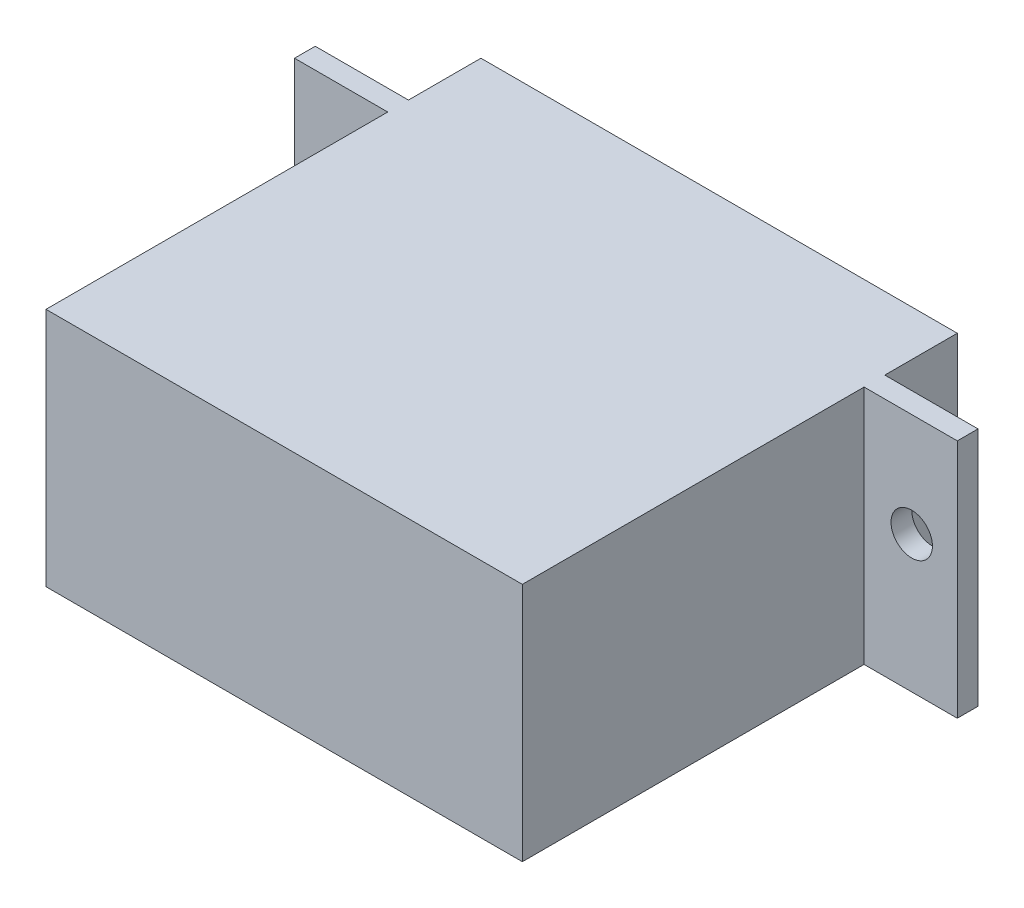
ISO-10303-21;
HEADER;
FILE_DESCRIPTION(('STEP AP214'),'2;1');
FILE_NAME('part.step','',(''),(''),'','','');
FILE_SCHEMA(('AUTOMOTIVE_DESIGN { 1 0 10303 214 1 1 1 1 }'));
ENDSEC;
DATA;
#1=APPLICATION_CONTEXT('core data for automotive mechanical design processes');
#2=APPLICATION_PROTOCOL_DEFINITION('international standard','automotive_design',2000,#1);
#3=PRODUCT_CONTEXT('',#1,'mechanical');
#4=PRODUCT('Part','Part','',(#3));
#5=PRODUCT_RELATED_PRODUCT_CATEGORY('part','',(#4));
#6=PRODUCT_DEFINITION_FORMATION('','',#4);
#7=PRODUCT_DEFINITION_CONTEXT('part definition',#1,'design');
#8=PRODUCT_DEFINITION('design','',#6,#7);
#9=PRODUCT_DEFINITION_SHAPE('','',#8);
#10=(LENGTH_UNIT() NAMED_UNIT(*) SI_UNIT(.MILLI.,.METRE.));
#11=(NAMED_UNIT(*) PLANE_ANGLE_UNIT() SI_UNIT($,.RADIAN.));
#12=(NAMED_UNIT(*) SI_UNIT($,.STERADIAN.) SOLID_ANGLE_UNIT());
#13=UNCERTAINTY_MEASURE_WITH_UNIT(LENGTH_MEASURE(1.E-05),#10,'distance_accuracy_value','');
#14=(GEOMETRIC_REPRESENTATION_CONTEXT(3) GLOBAL_UNCERTAINTY_ASSIGNED_CONTEXT((#13)) GLOBAL_UNIT_ASSIGNED_CONTEXT((#10,
#11,#12)) REPRESENTATION_CONTEXT('',''));
#15=CARTESIAN_POINT('',(0.,0.,0.));
#16=DIRECTION('',(0.,0.,1.));
#17=DIRECTION('',(1.,0.,0.));
#18=AXIS2_PLACEMENT_3D('',#15,#16,#17);
#19=CARTESIAN_POINT('',(-11.5,11.6,-10.5));
#20=DIRECTION('',(1.,0.,0.));
#21=DIRECTION('',(0.,0.,-1.));
#22=AXIS2_PLACEMENT_3D('',#19,#20,#21);
#23=PLANE('',#22);
#24=DIRECTION('',(0.,0.,1.));
#25=VECTOR('',#24,1.);
#26=CARTESIAN_POINT('',(-11.5,0.,-10.5));
#27=LINE('',#26,#25);
#28=CARTESIAN_POINT('',(-11.5,0.,-10.5));
#29=VERTEX_POINT('',#28);
#30=CARTESIAN_POINT('',(-11.5,0.,-7.));
#31=VERTEX_POINT('',#30);
#32=EDGE_CURVE('E255',#29,#31,#27,.T.);
#33=ORIENTED_EDGE('',*,*,#32,.T.);
#34=DIRECTION('',(0.,1.,0.));
#35=VECTOR('',#34,1.);
#36=CARTESIAN_POINT('',(-11.5,0.,-7.));
#37=LINE('',#36,#35);
#38=CARTESIAN_POINT('',(-11.5,11.6,-7.));
#39=VERTEX_POINT('',#38);
#40=EDGE_CURVE('E172',#31,#39,#37,.T.);
#41=ORIENTED_EDGE('',*,*,#40,.T.);
#42=DIRECTION('',(0.,0.,1.));
#43=VECTOR('',#42,1.);
#44=CARTESIAN_POINT('',(-11.5,11.6,-10.5));
#45=LINE('',#44,#43);
#46=CARTESIAN_POINT('',(-11.5,11.6,-10.5));
#47=VERTEX_POINT('',#46);
#48=EDGE_CURVE('E241',#47,#39,#45,.T.);
#49=ORIENTED_EDGE('',*,*,#48,.F.);
#50=DIRECTION('',(0.,-1.,0.));
#51=VECTOR('',#50,1.);
#52=CARTESIAN_POINT('',(-11.5,11.6,-10.5));
#53=LINE('',#52,#51);
#54=EDGE_CURVE('E269',#47,#29,#53,.T.);
#55=ORIENTED_EDGE('',*,*,#54,.T.);
#56=EDGE_LOOP('',(#33,#41,#49,#55));
#57=FACE_BOUND('',#56,.T.);
#58=ADVANCED_FACE('F42',(#57),#23,.F.);
#59=CARTESIAN_POINT('',(11.5,11.6,-10.5));
#60=DIRECTION('',(-1.,0.,0.));
#61=DIRECTION('',(0.,0.,1.));
#62=AXIS2_PLACEMENT_3D('',#59,#60,#61);
#63=PLANE('',#62);
#64=DIRECTION('',(0.,-1.,0.));
#65=VECTOR('',#64,1.);
#66=CARTESIAN_POINT('',(11.5,11.6,-6.));
#67=LINE('',#66,#65);
#68=CARTESIAN_POINT('',(11.5,11.6,-6.));
#69=VERTEX_POINT('',#68);
#70=CARTESIAN_POINT('',(11.5,0.,-6.));
#71=VERTEX_POINT('',#70);
#72=EDGE_CURVE('E70',#69,#71,#67,.T.);
#73=ORIENTED_EDGE('',*,*,#72,.F.);
#74=DIRECTION('',(0.,0.,-1.));
#75=VECTOR('',#74,1.);
#76=CARTESIAN_POINT('',(11.5,11.6,-10.5));
#77=LINE('',#76,#75);
#78=CARTESIAN_POINT('',(11.5,11.6,10.5));
#79=VERTEX_POINT('',#78);
#80=EDGE_CURVE('E233',#79,#69,#77,.T.);
#81=ORIENTED_EDGE('',*,*,#80,.F.);
#82=DIRECTION('',(0.,-1.,0.));
#83=VECTOR('',#82,1.);
#84=CARTESIAN_POINT('',(11.5,11.6,10.5));
#85=LINE('',#84,#83);
#86=CARTESIAN_POINT('',(11.5,0.,10.5));
#87=VERTEX_POINT('',#86);
#88=EDGE_CURVE('E248',#79,#87,#85,.T.);
#89=ORIENTED_EDGE('',*,*,#88,.T.);
#90=DIRECTION('',(0.,0.,-1.));
#91=VECTOR('',#90,1.);
#92=CARTESIAN_POINT('',(11.5,0.,-10.5));
#93=LINE('',#92,#91);
#94=EDGE_CURVE('E249',#87,#71,#93,.T.);
#95=ORIENTED_EDGE('',*,*,#94,.T.);
#96=EDGE_LOOP('',(#73,#81,#89,#95));
#97=FACE_BOUND('',#96,.T.);
#98=ADVANCED_FACE('F44',(#97),#63,.F.);
#99=DIRECTION('',(0.,1.,0.));
#100=VECTOR('',#99,1.);
#101=CARTESIAN_POINT('',(11.5,0.,-7.));
#102=LINE('',#101,#100);
#103=CARTESIAN_POINT('',(11.5,0.,-7.));
#104=VERTEX_POINT('',#103);
#105=CARTESIAN_POINT('',(11.5,11.6,-7.));
#106=VERTEX_POINT('',#105);
#107=EDGE_CURVE('E161',#104,#106,#102,.T.);
#108=ORIENTED_EDGE('',*,*,#107,.F.);
#109=CARTESIAN_POINT('',(11.5,0.,-10.5));
#110=VERTEX_POINT('',#109);
#111=EDGE_CURVE('E232',#104,#110,#93,.T.);
#112=ORIENTED_EDGE('',*,*,#111,.T.);
#113=DIRECTION('',(0.,-1.,0.));
#114=VECTOR('',#113,1.);
#115=CARTESIAN_POINT('',(11.5,11.6,-10.5));
#116=LINE('',#115,#114);
#117=CARTESIAN_POINT('',(11.5,11.6,-10.5));
#118=VERTEX_POINT('',#117);
#119=EDGE_CURVE('E52',#118,#110,#116,.T.);
#120=ORIENTED_EDGE('',*,*,#119,.F.);
#121=EDGE_CURVE('E237',#106,#118,#77,.T.);
#122=ORIENTED_EDGE('',*,*,#121,.F.);
#123=EDGE_LOOP('',(#108,#112,#120,#122));
#124=FACE_BOUND('',#123,.T.);
#125=ADVANCED_FACE('F283',(#124),#63,.F.);
#126=CARTESIAN_POINT('',(-11.5,11.6,-10.5));
#127=DIRECTION('',(0.,0.,1.));
#128=DIRECTION('',(1.,0.,0.));
#129=AXIS2_PLACEMENT_3D('',#126,#127,#128);
#130=PLANE('',#129);
#131=CARTESIAN_POINT('',(5.5,5.8,-10.5));
#132=DIRECTION('',(0.,0.,1.));
#133=DIRECTION('',(1.,0.,0.));
#134=AXIS2_PLACEMENT_3D('',#131,#132,#133);
#135=CIRCLE('',#134,2.);
#136=CARTESIAN_POINT('',(7.5,5.8,-10.5));
#137=VERTEX_POINT('',#136);
#138=EDGE_CURVE('E11',#137,#137,#135,.F.);
#139=ORIENTED_EDGE('',*,*,#138,.F.);
#140=EDGE_LOOP('',(#139));
#141=FACE_BOUND('',#140,.T.);
#142=DIRECTION('',(-1.,0.,0.));
#143=VECTOR('',#142,1.);
#144=CARTESIAN_POINT('',(-11.5,0.,-10.5));
#145=LINE('',#144,#143);
#146=EDGE_CURVE('E252',#110,#29,#145,.T.);
#147=ORIENTED_EDGE('',*,*,#146,.T.);
#148=ORIENTED_EDGE('',*,*,#54,.F.);
#149=DIRECTION('',(-1.,0.,0.));
#150=VECTOR('',#149,1.);
#151=CARTESIAN_POINT('',(-11.5,11.6,-10.5));
#152=LINE('',#151,#150);
#153=EDGE_CURVE('E236',#118,#47,#152,.T.);
#154=ORIENTED_EDGE('',*,*,#153,.F.);
#155=ORIENTED_EDGE('',*,*,#119,.T.);
#156=EDGE_LOOP('',(#147,#148,#154,#155));
#157=FACE_BOUND('',#156,.T.);
#158=ADVANCED_FACE('F279',(#141,#157),#130,.F.);
#159=CARTESIAN_POINT('',(-11.5,11.6,-6.));
#160=VERTEX_POINT('',#159);
#161=CARTESIAN_POINT('',(-11.5,11.6,10.5));
#162=VERTEX_POINT('',#161);
#163=EDGE_CURVE('E240',#160,#162,#45,.T.);
#164=ORIENTED_EDGE('',*,*,#163,.F.);
#165=DIRECTION('',(0.,-1.,0.));
#166=VECTOR('',#165,1.);
#167=CARTESIAN_POINT('',(-11.5,11.6,-6.));
#168=LINE('',#167,#166);
#169=CARTESIAN_POINT('',(-11.5,0.,-6.));
#170=VERTEX_POINT('',#169);
#171=EDGE_CURVE('E186',#160,#170,#168,.T.);
#172=ORIENTED_EDGE('',*,*,#171,.T.);
#173=CARTESIAN_POINT('',(-11.5,0.,10.5));
#174=VERTEX_POINT('',#173);
#175=EDGE_CURVE('E160',#170,#174,#27,.T.);
#176=ORIENTED_EDGE('',*,*,#175,.T.);
#177=DIRECTION('',(0.,-1.,0.));
#178=VECTOR('',#177,1.);
#179=CARTESIAN_POINT('',(-11.5,11.6,10.5));
#180=LINE('',#179,#178);
#181=EDGE_CURVE('E265',#162,#174,#180,.T.);
#182=ORIENTED_EDGE('',*,*,#181,.F.);
#183=EDGE_LOOP('',(#164,#172,#176,#182));
#184=FACE_BOUND('',#183,.T.);
#185=ADVANCED_FACE('F335',(#184),#23,.F.);
#186=CARTESIAN_POINT('',(-11.5,11.6,10.5));
#187=DIRECTION('',(0.,0.,-1.));
#188=DIRECTION('',(-1.,0.,0.));
#189=AXIS2_PLACEMENT_3D('',#186,#187,#188);
#190=PLANE('',#189);
#191=DIRECTION('',(1.,0.,0.));
#192=VECTOR('',#191,1.);
#193=CARTESIAN_POINT('',(-11.5,0.,10.5));
#194=LINE('',#193,#192);
#195=EDGE_CURVE('E259',#174,#87,#194,.T.);
#196=ORIENTED_EDGE('',*,*,#195,.T.);
#197=ORIENTED_EDGE('',*,*,#88,.F.);
#198=DIRECTION('',(1.,0.,0.));
#199=VECTOR('',#198,1.);
#200=CARTESIAN_POINT('',(-11.5,11.6,10.5));
#201=LINE('',#200,#199);
#202=EDGE_CURVE('E245',#162,#79,#201,.T.);
#203=ORIENTED_EDGE('',*,*,#202,.F.);
#204=ORIENTED_EDGE('',*,*,#181,.T.);
#205=EDGE_LOOP('',(#196,#197,#203,#204));
#206=FACE_BOUND('',#205,.T.);
#207=ADVANCED_FACE('F341',(#206),#190,.F.);
#208=CARTESIAN_POINT('',(0.,11.6,0.));
#209=DIRECTION('',(0.,1.,0.));
#210=DIRECTION('',(0.,0.,1.));
#211=AXIS2_PLACEMENT_3D('',#208,#209,#210);
#212=PLANE('',#211);
#213=ORIENTED_EDGE('',*,*,#80,.T.);
#214=DIRECTION('',(-1.,0.,0.));
#215=VECTOR('',#214,1.);
#216=CARTESIAN_POINT('',(16.,11.6,-6.));
#217=LINE('',#216,#215);
#218=CARTESIAN_POINT('',(16.,11.6,-6.));
#219=VERTEX_POINT('',#218);
#220=EDGE_CURVE('E221',#219,#69,#217,.T.);
#221=ORIENTED_EDGE('',*,*,#220,.F.);
#222=DIRECTION('',(0.,0.,1.));
#223=VECTOR('',#222,1.);
#224=CARTESIAN_POINT('',(16.,11.6,-7.));
#225=LINE('',#224,#223);
#226=CARTESIAN_POINT('',(16.,11.6,-7.));
#227=VERTEX_POINT('',#226);
#228=EDGE_CURVE('E206',#227,#219,#225,.T.);
#229=ORIENTED_EDGE('',*,*,#228,.F.);
#230=DIRECTION('',(-1.,0.,0.));
#231=VECTOR('',#230,1.);
#232=CARTESIAN_POINT('',(16.,11.6,-7.));
#233=LINE('',#232,#231);
#234=EDGE_CURVE('E225',#227,#106,#233,.T.);
#235=ORIENTED_EDGE('',*,*,#234,.T.);
#236=ORIENTED_EDGE('',*,*,#121,.T.);
#237=ORIENTED_EDGE('',*,*,#153,.T.);
#238=ORIENTED_EDGE('',*,*,#48,.T.);
#239=DIRECTION('',(1.,0.,0.));
#240=VECTOR('',#239,1.);
#241=CARTESIAN_POINT('',(-16.,11.6,-7.));
#242=LINE('',#241,#240);
#243=CARTESIAN_POINT('',(-16.,11.6,-7.));
#244=VERTEX_POINT('',#243);
#245=EDGE_CURVE('E194',#244,#39,#242,.T.);
#246=ORIENTED_EDGE('',*,*,#245,.F.);
#247=DIRECTION('',(0.,0.,1.));
#248=VECTOR('',#247,1.);
#249=CARTESIAN_POINT('',(-16.,11.6,-7.));
#250=LINE('',#249,#248);
#251=CARTESIAN_POINT('',(-16.,11.6,-6.));
#252=VERTEX_POINT('',#251);
#253=EDGE_CURVE('E176',#244,#252,#250,.T.);
#254=ORIENTED_EDGE('',*,*,#253,.T.);
#255=DIRECTION('',(1.,0.,0.));
#256=VECTOR('',#255,1.);
#257=CARTESIAN_POINT('',(-16.,11.6,-6.));
#258=LINE('',#257,#256);
#259=EDGE_CURVE('E162',#252,#160,#258,.T.);
#260=ORIENTED_EDGE('',*,*,#259,.T.);
#261=ORIENTED_EDGE('',*,*,#163,.T.);
#262=ORIENTED_EDGE('',*,*,#202,.T.);
#263=EDGE_LOOP('',(#213,#221,#229,#235,#236,#237,#238,#246,#254,#260,#261,#262));
#264=FACE_BOUND('',#263,.T.);
#265=ADVANCED_FACE('F292',(#264),#212,.T.);
#266=CARTESIAN_POINT('',(0.,0.,0.));
#267=DIRECTION('',(0.,1.,0.));
#268=DIRECTION('',(0.,0.,1.));
#269=AXIS2_PLACEMENT_3D('',#266,#267,#268);
#270=PLANE('',#269);
#271=ORIENTED_EDGE('',*,*,#94,.F.);
#272=ORIENTED_EDGE('',*,*,#195,.F.);
#273=ORIENTED_EDGE('',*,*,#175,.F.);
#274=DIRECTION('',(1.,0.,0.));
#275=VECTOR('',#274,1.);
#276=CARTESIAN_POINT('',(-16.,0.,-6.));
#277=LINE('',#276,#275);
#278=CARTESIAN_POINT('',(-16.,0.,-6.));
#279=VERTEX_POINT('',#278);
#280=EDGE_CURVE('E59',#279,#170,#277,.T.);
#281=ORIENTED_EDGE('',*,*,#280,.F.);
#282=DIRECTION('',(0.,0.,-1.));
#283=VECTOR('',#282,1.);
#284=CARTESIAN_POINT('',(-16.,0.,-6.));
#285=LINE('',#284,#283);
#286=CARTESIAN_POINT('',(-16.,0.,-7.));
#287=VERTEX_POINT('',#286);
#288=EDGE_CURVE('E157',#279,#287,#285,.T.);
#289=ORIENTED_EDGE('',*,*,#288,.T.);
#290=DIRECTION('',(1.,0.,0.));
#291=VECTOR('',#290,1.);
#292=CARTESIAN_POINT('',(-16.,0.,-7.));
#293=LINE('',#292,#291);
#294=EDGE_CURVE('E185',#287,#31,#293,.T.);
#295=ORIENTED_EDGE('',*,*,#294,.T.);
#296=ORIENTED_EDGE('',*,*,#32,.F.);
#297=ORIENTED_EDGE('',*,*,#146,.F.);
#298=ORIENTED_EDGE('',*,*,#111,.F.);
#299=DIRECTION('',(-1.,0.,0.));
#300=VECTOR('',#299,1.);
#301=CARTESIAN_POINT('',(16.,0.,-7.));
#302=LINE('',#301,#300);
#303=CARTESIAN_POINT('',(16.,0.,-7.));
#304=VERTEX_POINT('',#303);
#305=EDGE_CURVE('E229',#304,#104,#302,.T.);
#306=ORIENTED_EDGE('',*,*,#305,.F.);
#307=DIRECTION('',(0.,0.,-1.));
#308=VECTOR('',#307,1.);
#309=CARTESIAN_POINT('',(16.,0.,-6.));
#310=LINE('',#309,#308);
#311=CARTESIAN_POINT('',(16.,0.,-6.));
#312=VERTEX_POINT('',#311);
#313=EDGE_CURVE('E199',#312,#304,#310,.T.);
#314=ORIENTED_EDGE('',*,*,#313,.F.);
#315=DIRECTION('',(-1.,0.,0.));
#316=VECTOR('',#315,1.);
#317=CARTESIAN_POINT('',(16.,0.,-6.));
#318=LINE('',#317,#316);
#319=EDGE_CURVE('E212',#312,#71,#318,.T.);
#320=ORIENTED_EDGE('',*,*,#319,.T.);
#321=EDGE_LOOP('',(#271,#272,#273,#281,#289,#295,#296,#297,#298,#306,#314,#320));
#322=FACE_BOUND('',#321,.T.);
#323=ADVANCED_FACE('F156',(#322),#270,.F.);
#324=CARTESIAN_POINT('',(16.,0.,-7.));
#325=DIRECTION('',(0.,0.,1.));
#326=DIRECTION('',(1.,0.,0.));
#327=AXIS2_PLACEMENT_3D('',#324,#325,#326);
#328=PLANE('',#327);
#329=CARTESIAN_POINT('',(13.8,6.6,-7.));
#330=DIRECTION('',(0.,0.,-1.));
#331=DIRECTION('',(-1.,0.,0.));
#332=AXIS2_PLACEMENT_3D('',#329,#330,#331);
#333=CIRCLE('',#332,1.);
#334=CARTESIAN_POINT('',(12.8,6.6,-7.));
#335=VERTEX_POINT('',#334);
#336=EDGE_CURVE('E297',#335,#335,#333,.T.);
#337=ORIENTED_EDGE('',*,*,#336,.F.);
#338=EDGE_LOOP('',(#337));
#339=FACE_BOUND('',#338,.T.);
#340=ORIENTED_EDGE('',*,*,#107,.T.);
#341=ORIENTED_EDGE('',*,*,#234,.F.);
#342=DIRECTION('',(0.,1.,0.));
#343=VECTOR('',#342,1.);
#344=CARTESIAN_POINT('',(16.,0.,-7.));
#345=LINE('',#344,#343);
#346=EDGE_CURVE('E203',#304,#227,#345,.T.);
#347=ORIENTED_EDGE('',*,*,#346,.F.);
#348=ORIENTED_EDGE('',*,*,#305,.T.);
#349=EDGE_LOOP('',(#340,#341,#347,#348));
#350=FACE_BOUND('',#349,.T.);
#351=ADVANCED_FACE('F357',(#339,#350),#328,.F.);
#352=CARTESIAN_POINT('',(16.,11.6,-6.));
#353=DIRECTION('',(0.,0.,-1.));
#354=DIRECTION('',(0.,1.,0.));
#355=AXIS2_PLACEMENT_3D('',#352,#353,#354);
#356=PLANE('',#355);
#357=CARTESIAN_POINT('',(13.8,6.6,-6.));
#358=DIRECTION('',(0.,0.,-1.));
#359=DIRECTION('',(0.,1.,0.));
#360=AXIS2_PLACEMENT_3D('',#357,#358,#359);
#361=CIRCLE('',#360,1.);
#362=CARTESIAN_POINT('',(13.8,7.6,-6.));
#363=VERTEX_POINT('',#362);
#364=EDGE_CURVE('E46',#363,#363,#361,.T.);
#365=ORIENTED_EDGE('',*,*,#364,.T.);
#366=EDGE_LOOP('',(#365));
#367=FACE_BOUND('',#366,.T.);
#368=ORIENTED_EDGE('',*,*,#72,.T.);
#369=ORIENTED_EDGE('',*,*,#319,.F.);
#370=DIRECTION('',(0.,-1.,0.));
#371=VECTOR('',#370,1.);
#372=CARTESIAN_POINT('',(16.,11.6,-6.));
#373=LINE('',#372,#371);
#374=EDGE_CURVE('E209',#219,#312,#373,.T.);
#375=ORIENTED_EDGE('',*,*,#374,.F.);
#376=ORIENTED_EDGE('',*,*,#220,.T.);
#377=EDGE_LOOP('',(#368,#369,#375,#376));
#378=FACE_BOUND('',#377,.T.);
#379=ADVANCED_FACE('F362',(#367,#378),#356,.F.);
#380=CARTESIAN_POINT('',(16.,0.,0.));
#381=DIRECTION('',(1.,0.,0.));
#382=DIRECTION('',(0.,0.,-1.));
#383=AXIS2_PLACEMENT_3D('',#380,#381,#382);
#384=PLANE('',#383);
#385=ORIENTED_EDGE('',*,*,#313,.T.);
#386=ORIENTED_EDGE('',*,*,#346,.T.);
#387=ORIENTED_EDGE('',*,*,#228,.T.);
#388=ORIENTED_EDGE('',*,*,#374,.T.);
#389=EDGE_LOOP('',(#385,#386,#387,#388));
#390=FACE_BOUND('',#389,.T.);
#391=ADVANCED_FACE('F366',(#390),#384,.T.);
#392=CARTESIAN_POINT('',(-16.,11.6,-6.));
#393=DIRECTION('',(0.,0.,1.));
#394=DIRECTION('',(0.,-1.,0.));
#395=AXIS2_PLACEMENT_3D('',#392,#393,#394);
#396=PLANE('',#395);
#397=CARTESIAN_POINT('',(-13.8,6.6,-6.));
#398=DIRECTION('',(0.,0.,1.));
#399=DIRECTION('',(0.,-1.,0.));
#400=AXIS2_PLACEMENT_3D('',#397,#398,#399);
#401=CIRCLE('',#400,1.);
#402=CARTESIAN_POINT('',(-13.8,5.59999999999999,-6.));
#403=VERTEX_POINT('',#402);
#404=EDGE_CURVE('E301',#403,#403,#401,.T.);
#405=ORIENTED_EDGE('',*,*,#404,.F.);
#406=EDGE_LOOP('',(#405));
#407=FACE_BOUND('',#406,.T.);
#408=ORIENTED_EDGE('',*,*,#171,.F.);
#409=ORIENTED_EDGE('',*,*,#259,.F.);
#410=DIRECTION('',(0.,-1.,0.));
#411=VECTOR('',#410,1.);
#412=CARTESIAN_POINT('',(-16.,11.6,-6.));
#413=LINE('',#412,#411);
#414=EDGE_CURVE('E168',#252,#279,#413,.T.);
#415=ORIENTED_EDGE('',*,*,#414,.T.);
#416=ORIENTED_EDGE('',*,*,#280,.T.);
#417=EDGE_LOOP('',(#408,#409,#415,#416));
#418=FACE_BOUND('',#417,.T.);
#419=ADVANCED_FACE('F174',(#407,#418),#396,.T.);
#420=CARTESIAN_POINT('',(-16.,0.,-7.));
#421=DIRECTION('',(0.,0.,-1.));
#422=DIRECTION('',(-1.,0.,0.));
#423=AXIS2_PLACEMENT_3D('',#420,#421,#422);
#424=PLANE('',#423);
#425=CARTESIAN_POINT('',(-13.8,6.6,-7.));
#426=DIRECTION('',(0.,0.,-1.));
#427=DIRECTION('',(1.,0.,0.));
#428=AXIS2_PLACEMENT_3D('',#425,#426,#427);
#429=CIRCLE('',#428,1.);
#430=CARTESIAN_POINT('',(-12.8,6.6,-7.));
#431=VERTEX_POINT('',#430);
#432=EDGE_CURVE('E308',#431,#431,#429,.T.);
#433=ORIENTED_EDGE('',*,*,#432,.F.);
#434=EDGE_LOOP('',(#433));
#435=FACE_BOUND('',#434,.T.);
#436=ORIENTED_EDGE('',*,*,#40,.F.);
#437=ORIENTED_EDGE('',*,*,#294,.F.);
#438=DIRECTION('',(0.,1.,0.));
#439=VECTOR('',#438,1.);
#440=CARTESIAN_POINT('',(-16.,0.,-7.));
#441=LINE('',#440,#439);
#442=EDGE_CURVE('E171',#287,#244,#441,.T.);
#443=ORIENTED_EDGE('',*,*,#442,.T.);
#444=ORIENTED_EDGE('',*,*,#245,.T.);
#445=EDGE_LOOP('',(#436,#437,#443,#444));
#446=FACE_BOUND('',#445,.T.);
#447=ADVANCED_FACE('F373',(#435,#446),#424,.T.);
#448=CARTESIAN_POINT('',(-16.,0.,0.));
#449=DIRECTION('',(-1.,0.,0.));
#450=DIRECTION('',(0.,0.,-1.));
#451=AXIS2_PLACEMENT_3D('',#448,#449,#450);
#452=PLANE('',#451);
#453=ORIENTED_EDGE('',*,*,#288,.F.);
#454=ORIENTED_EDGE('',*,*,#414,.F.);
#455=ORIENTED_EDGE('',*,*,#253,.F.);
#456=ORIENTED_EDGE('',*,*,#442,.F.);
#457=EDGE_LOOP('',(#453,#454,#455,#456));
#458=FACE_BOUND('',#457,.T.);
#459=ADVANCED_FACE('F166',(#458),#452,.T.);
#460=CARTESIAN_POINT('',(5.5,5.8,-14.2));
#461=DIRECTION('',(0.,0.,-1.));
#462=DIRECTION('',(-1.,0.,0.));
#463=AXIS2_PLACEMENT_3D('',#460,#461,#462);
#464=PLANE('',#463);
#465=CARTESIAN_POINT('',(5.5,5.8,-14.2));
#466=DIRECTION('',(0.,0.,-1.));
#467=DIRECTION('',(-1.,0.,0.));
#468=AXIS2_PLACEMENT_3D('',#465,#466,#467);
#469=CIRCLE('',#468,2.);
#470=CARTESIAN_POINT('',(3.5,5.8,-14.2));
#471=VERTEX_POINT('',#470);
#472=EDGE_CURVE('E189',#471,#471,#469,.T.);
#473=ORIENTED_EDGE('',*,*,#472,.T.);
#474=EDGE_LOOP('',(#473));
#475=FACE_BOUND('',#474,.T.);
#476=CARTESIAN_POINT('',(5.5,5.8,-14.2));
#477=DIRECTION('',(0.,0.,-1.));
#478=DIRECTION('',(-1.,0.,0.));
#479=AXIS2_PLACEMENT_3D('',#476,#477,#478);
#480=CIRCLE('',#479,0.6);
#481=CARTESIAN_POINT('',(4.9,5.8,-14.2));
#482=VERTEX_POINT('',#481);
#483=EDGE_CURVE('E304',#482,#482,#480,.T.);
#484=ORIENTED_EDGE('',*,*,#483,.F.);
#485=EDGE_LOOP('',(#484));
#486=FACE_BOUND('',#485,.T.);
#487=ADVANCED_FACE('F324',(#475,#486),#464,.T.);
#488=CARTESIAN_POINT('',(5.5,5.8,-14.2));
#489=DIRECTION('',(0.,0.,1.));
#490=DIRECTION('',(1.,0.,0.));
#491=AXIS2_PLACEMENT_3D('',#488,#489,#490);
#492=CYLINDRICAL_SURFACE('',#491,2.);
#493=ORIENTED_EDGE('',*,*,#472,.F.);
#494=EDGE_LOOP('',(#493));
#495=FACE_BOUND('',#494,.T.);
#496=ORIENTED_EDGE('',*,*,#138,.T.);
#497=EDGE_LOOP('',(#496));
#498=FACE_BOUND('',#497,.T.);
#499=ADVANCED_FACE('F327',(#495,#498),#492,.T.);
#500=CARTESIAN_POINT('',(5.5,5.8,-14.2));
#501=DIRECTION('',(0.,0.,1.));
#502=DIRECTION('',(1.,0.,0.));
#503=AXIS2_PLACEMENT_3D('',#500,#501,#502);
#504=CYLINDRICAL_SURFACE('',#503,0.6);
#505=ORIENTED_EDGE('',*,*,#483,.T.);
#506=EDGE_LOOP('',(#505));
#507=FACE_BOUND('',#506,.T.);
#508=CARTESIAN_POINT('',(5.5,5.8,-10.5));
#509=DIRECTION('',(0.,0.,-1.));
#510=DIRECTION('',(-1.,0.,0.));
#511=AXIS2_PLACEMENT_3D('',#508,#509,#510);
#512=CIRCLE('',#511,0.6);
#513=CARTESIAN_POINT('',(4.9,5.8,-10.5));
#514=VERTEX_POINT('',#513);
#515=EDGE_CURVE('E300',#514,#514,#512,.T.);
#516=ORIENTED_EDGE('',*,*,#515,.F.);
#517=EDGE_LOOP('',(#516));
#518=FACE_BOUND('',#517,.T.);
#519=ADVANCED_FACE('F330',(#507,#518),#504,.F.);
#520=ORIENTED_EDGE('',*,*,#515,.T.);
#521=EDGE_LOOP('',(#520));
#522=FACE_BOUND('',#521,.T.);
#523=ADVANCED_FACE('F336',(#522),#130,.F.);
#524=CARTESIAN_POINT('',(-13.8,6.6,-2.));
#525=DIRECTION('',(0.,0.,-1.));
#526=DIRECTION('',(-1.,0.,0.));
#527=AXIS2_PLACEMENT_3D('',#524,#525,#526);
#528=CYLINDRICAL_SURFACE('',#527,1.);
#529=ORIENTED_EDGE('',*,*,#404,.T.);
#530=EDGE_LOOP('',(#529));
#531=FACE_BOUND('',#530,.T.);
#532=ORIENTED_EDGE('',*,*,#432,.T.);
#533=EDGE_LOOP('',(#532));
#534=FACE_BOUND('',#533,.T.);
#535=ADVANCED_FACE('F345',(#531,#534),#528,.F.);
#536=CARTESIAN_POINT('',(13.8,6.6,-2.));
#537=DIRECTION('',(0.,0.,-1.));
#538=DIRECTION('',(-1.,0.,0.));
#539=AXIS2_PLACEMENT_3D('',#536,#537,#538);
#540=CYLINDRICAL_SURFACE('',#539,1.);
#541=ORIENTED_EDGE('',*,*,#336,.T.);
#542=EDGE_LOOP('',(#541));
#543=FACE_BOUND('',#542,.T.);
#544=ORIENTED_EDGE('',*,*,#364,.F.);
#545=EDGE_LOOP('',(#544));
#546=FACE_BOUND('',#545,.T.);
#547=ADVANCED_FACE('F387',(#543,#546),#540,.F.);
#548=CLOSED_SHELL('',(#58,#98,#125,#158,#185,#207,#265,#323,#351,#379,#391,#419,#447,#459,#487,
#499,#519,#523,#535,#547));
#549=MANIFOLD_SOLID_BREP('B2',#548);
#550=ADVANCED_BREP_SHAPE_REPRESENTATION('',(#18,#549),#14);
#551=SHAPE_DEFINITION_REPRESENTATION(#9,#550);
ENDSEC;
END-ISO-10303-21;
